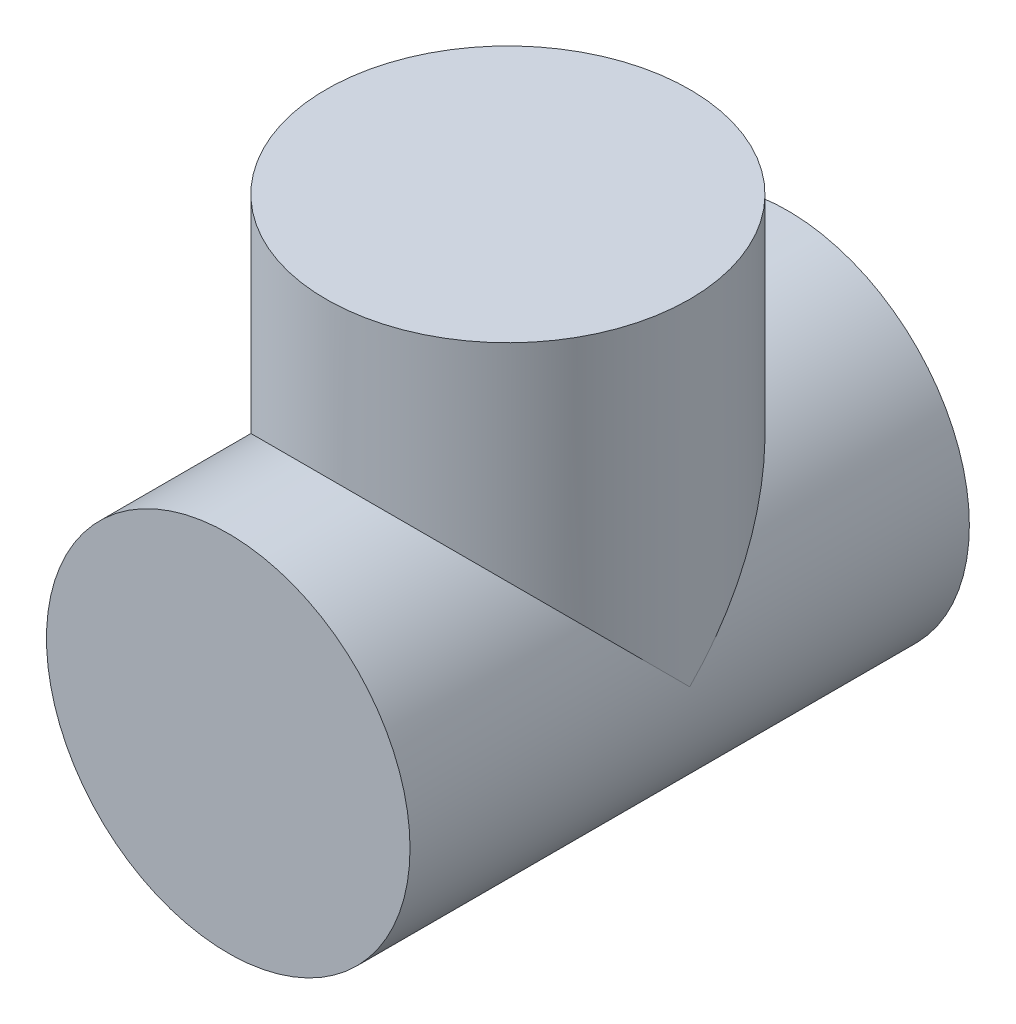
ISO-10303-21;
HEADER;
FILE_DESCRIPTION(('STEP AP214'),'2;1');
FILE_NAME('part.step','',(''),(''),'','','');
FILE_SCHEMA(('AUTOMOTIVE_DESIGN { 1 0 10303 214 1 1 1 1 }'));
ENDSEC;
DATA;
#1=APPLICATION_CONTEXT('core data for automotive mechanical design processes');
#2=APPLICATION_PROTOCOL_DEFINITION('international standard','automotive_design',2000,#1);
#3=PRODUCT_CONTEXT('',#1,'mechanical');
#4=PRODUCT('Part','Part','',(#3));
#5=PRODUCT_RELATED_PRODUCT_CATEGORY('part','',(#4));
#6=PRODUCT_DEFINITION_FORMATION('','',#4);
#7=PRODUCT_DEFINITION_CONTEXT('part definition',#1,'design');
#8=PRODUCT_DEFINITION('design','',#6,#7);
#9=PRODUCT_DEFINITION_SHAPE('','',#8);
#10=(LENGTH_UNIT() NAMED_UNIT(*) SI_UNIT(.MILLI.,.METRE.));
#11=(NAMED_UNIT(*) PLANE_ANGLE_UNIT() SI_UNIT($,.RADIAN.));
#12=(NAMED_UNIT(*) SI_UNIT($,.STERADIAN.) SOLID_ANGLE_UNIT());
#13=UNCERTAINTY_MEASURE_WITH_UNIT(LENGTH_MEASURE(1.E-05),#10,'distance_accuracy_value','');
#14=(GEOMETRIC_REPRESENTATION_CONTEXT(3) GLOBAL_UNCERTAINTY_ASSIGNED_CONTEXT((#13)) GLOBAL_UNIT_ASSIGNED_CONTEXT((#10,
#11,#12)) REPRESENTATION_CONTEXT('',''));
#15=CARTESIAN_POINT('',(0.,0.,0.));
#16=DIRECTION('',(0.,0.,1.));
#17=DIRECTION('',(1.,0.,0.));
#18=AXIS2_PLACEMENT_3D('',#15,#16,#17);
#19=CARTESIAN_POINT('',(0.,-143.1,-50.));
#20=DIRECTION('',(0.,1.,0.));
#21=DIRECTION('',(0.,0.,1.));
#22=AXIS2_PLACEMENT_3D('',#19,#20,#21);
#23=CYLINDRICAL_SURFACE('',#22,65.);
#24=CARTESIAN_POINT('',(0.,120.,-50.));
#25=DIRECTION('',(0.,-1.,0.));
#26=DIRECTION('',(1.,0.,0.));
#27=AXIS2_PLACEMENT_3D('',#24,#25,#26);
#28=CIRCLE('',#27,65.);
#29=CARTESIAN_POINT('',(65.,120.,-50.));
#30=VERTEX_POINT('',#29);
#31=EDGE_CURVE('E44',#30,#30,#28,.T.);
#32=ORIENTED_EDGE('',*,*,#31,.T.);
#33=EDGE_LOOP('',(#32));
#34=FACE_BOUND('',#33,.T.);
#35=CARTESIAN_POINT('',(0.,0.,-50.));
#36=DIRECTION('',(0.,0.707106781186547,0.707106781186547));
#37=DIRECTION('',(0.,-0.707106781186548,0.707106781186548));
#38=AXIS2_PLACEMENT_3D('',#35,#36,#37);
#39=ELLIPSE('',#38,91.9238815542512,65.);
#40=CARTESIAN_POINT('',(65.,0.,-50.));
#41=VERTEX_POINT('',#40);
#42=CARTESIAN_POINT('',(-65.,0.,-50.));
#43=VERTEX_POINT('',#42);
#44=EDGE_CURVE('E59',#41,#43,#39,.T.);
#45=ORIENTED_EDGE('',*,*,#44,.T.);
#46=CARTESIAN_POINT('',(0.,0.,-50.));
#47=DIRECTION('',(0.,0.707106781186547,-0.707106781186547));
#48=DIRECTION('',(0.,-0.707106781186548,-0.707106781186548));
#49=AXIS2_PLACEMENT_3D('',#46,#47,#48);
#50=ELLIPSE('',#49,91.9238815542512,65.);
#51=EDGE_CURVE('E11',#43,#41,#50,.T.);
#52=ORIENTED_EDGE('',*,*,#51,.T.);
#53=EDGE_LOOP('',(#45,#52));
#54=FACE_BOUND('',#53,.T.);
#55=ADVANCED_FACE('F40',(#34,#54),#23,.T.);
#56=CARTESIAN_POINT('',(0.,120.,-50.));
#57=DIRECTION('',(0.,-1.,0.));
#58=DIRECTION('',(1.,0.,0.));
#59=AXIS2_PLACEMENT_3D('',#56,#57,#58);
#60=PLANE('',#59);
#61=ORIENTED_EDGE('',*,*,#31,.F.);
#62=EDGE_LOOP('',(#61));
#63=FACE_BOUND('',#62,.T.);
#64=ADVANCED_FACE('F42',(#63),#60,.F.);
#65=CARTESIAN_POINT('',(0.,0.,50.));
#66=DIRECTION('',(0.,0.,1.));
#67=DIRECTION('',(1.,0.,0.));
#68=AXIS2_PLACEMENT_3D('',#65,#66,#67);
#69=PLANE('',#68);
#70=CARTESIAN_POINT('',(0.,0.,50.));
#71=DIRECTION('',(0.,0.,1.));
#72=DIRECTION('',(1.,0.,0.));
#73=AXIS2_PLACEMENT_3D('',#70,#71,#72);
#74=CIRCLE('',#73,65.);
#75=CARTESIAN_POINT('',(65.,0.,50.));
#76=VERTEX_POINT('',#75);
#77=EDGE_CURVE('E50',#76,#76,#74,.T.);
#78=ORIENTED_EDGE('',*,*,#77,.T.);
#79=EDGE_LOOP('',(#78));
#80=FACE_BOUND('',#79,.T.);
#81=ADVANCED_FACE('F73',(#80),#69,.T.);
#82=CARTESIAN_POINT('',(0.,0.,50.));
#83=DIRECTION('',(0.,0.,-1.));
#84=DIRECTION('',(-1.,0.,0.));
#85=AXIS2_PLACEMENT_3D('',#82,#83,#84);
#86=CYLINDRICAL_SURFACE('',#85,65.);
#87=ORIENTED_EDGE('',*,*,#51,.F.);
#88=ORIENTED_EDGE('',*,*,#44,.F.);
#89=EDGE_LOOP('',(#87,#88));
#90=FACE_BOUND('',#89,.T.);
#91=ORIENTED_EDGE('',*,*,#77,.F.);
#92=EDGE_LOOP('',(#91));
#93=FACE_BOUND('',#92,.T.);
#94=CARTESIAN_POINT('',(0.,0.,-150.));
#95=DIRECTION('',(0.,0.,1.));
#96=DIRECTION('',(1.,0.,0.));
#97=AXIS2_PLACEMENT_3D('',#94,#95,#96);
#98=CIRCLE('',#97,65.);
#99=CARTESIAN_POINT('',(65.,0.,-150.));
#100=VERTEX_POINT('',#99);
#101=EDGE_CURVE('E61',#100,#100,#98,.F.);
#102=ORIENTED_EDGE('',*,*,#101,.F.);
#103=EDGE_LOOP('',(#102));
#104=FACE_BOUND('',#103,.T.);
#105=ADVANCED_FACE('F57',(#90,#93,#104),#86,.T.);
#106=CARTESIAN_POINT('',(0.,0.,-150.));
#107=DIRECTION('',(0.,0.,-1.));
#108=DIRECTION('',(1.,0.,0.));
#109=AXIS2_PLACEMENT_3D('',#106,#107,#108);
#110=PLANE('',#109);
#111=ORIENTED_EDGE('',*,*,#101,.T.);
#112=EDGE_LOOP('',(#111));
#113=FACE_BOUND('',#112,.T.);
#114=ADVANCED_FACE('F76',(#113),#110,.T.);
#115=CLOSED_SHELL('',(#55,#64,#81,#105,#114));
#116=MANIFOLD_SOLID_BREP('B2',#115);
#117=ADVANCED_BREP_SHAPE_REPRESENTATION('',(#18,#116),#14);
#118=SHAPE_DEFINITION_REPRESENTATION(#9,#117);
ENDSEC;
END-ISO-10303-21;
